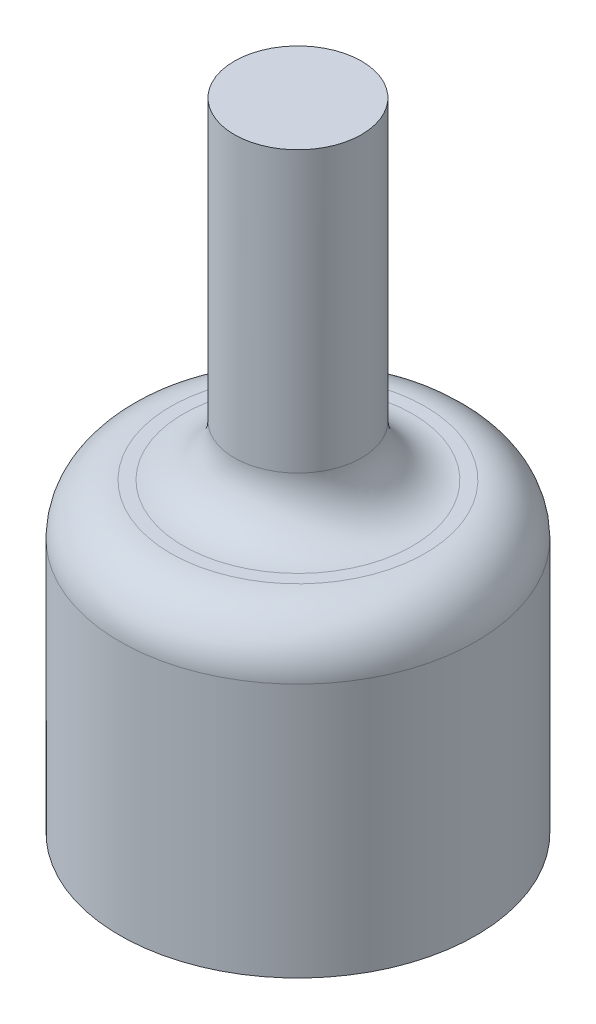
ISO-10303-21;
HEADER;
FILE_DESCRIPTION(('STEP AP214'),'2;1');
FILE_NAME('part.step','',(''),(''),'','','');
FILE_SCHEMA(('AUTOMOTIVE_DESIGN { 1 0 10303 214 1 1 1 1 }'));
ENDSEC;
DATA;
#1=APPLICATION_CONTEXT('core data for automotive mechanical design processes');
#2=APPLICATION_PROTOCOL_DEFINITION('international standard','automotive_design',2000,#1);
#3=PRODUCT_CONTEXT('',#1,'mechanical');
#4=PRODUCT('Part','Part','',(#3));
#5=PRODUCT_RELATED_PRODUCT_CATEGORY('part','',(#4));
#6=PRODUCT_DEFINITION_FORMATION('','',#4);
#7=PRODUCT_DEFINITION_CONTEXT('part definition',#1,'design');
#8=PRODUCT_DEFINITION('design','',#6,#7);
#9=PRODUCT_DEFINITION_SHAPE('','',#8);
#10=(LENGTH_UNIT() NAMED_UNIT(*) SI_UNIT(.MILLI.,.METRE.));
#11=(NAMED_UNIT(*) PLANE_ANGLE_UNIT() SI_UNIT($,.RADIAN.));
#12=(NAMED_UNIT(*) SI_UNIT($,.STERADIAN.) SOLID_ANGLE_UNIT());
#13=UNCERTAINTY_MEASURE_WITH_UNIT(LENGTH_MEASURE(1.E-05),#10,'distance_accuracy_value','');
#14=(GEOMETRIC_REPRESENTATION_CONTEXT(3) GLOBAL_UNCERTAINTY_ASSIGNED_CONTEXT((#13)) GLOBAL_UNIT_ASSIGNED_CONTEXT((#10,
#11,#12)) REPRESENTATION_CONTEXT('',''));
#15=CARTESIAN_POINT('',(0.,0.,0.));
#16=DIRECTION('',(0.,0.,1.));
#17=DIRECTION('',(1.,0.,0.));
#18=AXIS2_PLACEMENT_3D('',#15,#16,#17);
#19=CARTESIAN_POINT('',(0.,20.,0.));
#20=DIRECTION('',(0.,-1.,0.));
#21=DIRECTION('',(0.,0.,-1.));
#22=AXIS2_PLACEMENT_3D('',#19,#20,#21);
#23=CYLINDRICAL_SURFACE('',#22,2.5);
#24=CARTESIAN_POINT('',(0.,9.,0.));
#25=DIRECTION('',(0.,-1.,0.));
#26=DIRECTION('',(0.,0.,-1.));
#27=AXIS2_PLACEMENT_3D('',#24,#25,#26);
#28=CIRCLE('',#27,2.5);
#29=CARTESIAN_POINT('',(0.,9.,-2.5));
#30=VERTEX_POINT('',#29);
#31=EDGE_CURVE('E105',#30,#30,#28,.F.);
#32=ORIENTED_EDGE('',*,*,#31,.T.);
#33=EDGE_LOOP('',(#32));
#34=FACE_BOUND('',#33,.T.);
#35=CARTESIAN_POINT('',(0.,20.,0.));
#36=DIRECTION('',(0.,1.,0.));
#37=DIRECTION('',(0.,0.,1.));
#38=AXIS2_PLACEMENT_3D('',#35,#36,#37);
#39=CIRCLE('',#38,2.5);
#40=CARTESIAN_POINT('',(0.,20.,2.5));
#41=VERTEX_POINT('',#40);
#42=EDGE_CURVE('E81',#41,#41,#39,.T.);
#43=ORIENTED_EDGE('',*,*,#42,.F.);
#44=EDGE_LOOP('',(#43));
#45=FACE_BOUND('',#44,.T.);
#46=ADVANCED_FACE('F44',(#34,#45),#23,.T.);
#47=CARTESIAN_POINT('',(0.,20.,0.));
#48=DIRECTION('',(0.,1.,0.));
#49=DIRECTION('',(0.,0.,1.));
#50=AXIS2_PLACEMENT_3D('',#47,#48,#49);
#51=PLANE('',#50);
#52=ORIENTED_EDGE('',*,*,#42,.T.);
#53=EDGE_LOOP('',(#52));
#54=FACE_BOUND('',#53,.T.);
#55=ADVANCED_FACE('F124',(#54),#51,.T.);
#56=CARTESIAN_POINT('',(0.,7.,0.));
#57=DIRECTION('',(0.,-1.,0.));
#58=DIRECTION('',(0.,0.,-1.));
#59=AXIS2_PLACEMENT_3D('',#56,#57,#58);
#60=PLANE('',#59);
#61=CARTESIAN_POINT('',(0.,7.,0.));
#62=DIRECTION('',(0.,-1.,0.));
#63=DIRECTION('',(0.,0.,-1.));
#64=AXIS2_PLACEMENT_3D('',#61,#62,#63);
#65=CIRCLE('',#64,5.);
#66=CARTESIAN_POINT('',(0.,7.,-5.));
#67=VERTEX_POINT('',#66);
#68=EDGE_CURVE('E11',#67,#67,#65,.F.);
#69=ORIENTED_EDGE('',*,*,#68,.T.);
#70=EDGE_LOOP('',(#69));
#71=FACE_BOUND('',#70,.T.);
#72=CARTESIAN_POINT('',(0.,7.,0.));
#73=DIRECTION('',(0.,-1.,0.));
#74=DIRECTION('',(0.,0.,-1.));
#75=AXIS2_PLACEMENT_3D('',#72,#73,#74);
#76=CIRCLE('',#75,4.5);
#77=CARTESIAN_POINT('',(0.,7.,-4.5));
#78=VERTEX_POINT('',#77);
#79=EDGE_CURVE('E80',#78,#78,#76,.T.);
#80=ORIENTED_EDGE('',*,*,#79,.T.);
#81=EDGE_LOOP('',(#80));
#82=FACE_BOUND('',#81,.T.);
#83=ADVANCED_FACE('F130',(#71,#82),#60,.F.);
#84=CARTESIAN_POINT('',(0.,-5.,1.75));
#85=DIRECTION('',(0.,0.,1.));
#86=DIRECTION('',(1.,0.,0.));
#87=AXIS2_PLACEMENT_3D('',#84,#85,#86);
#88=PLANE('',#87);
#89=DIRECTION('',(0.,1.,0.));
#90=VECTOR('',#89,1.);
#91=CARTESIAN_POINT('',(-2.37486841740758,-5.,1.75));
#92=LINE('',#91,#90);
#93=CARTESIAN_POINT('',(-2.37486841740758,-5.,1.75));
#94=VERTEX_POINT('',#93);
#95=CARTESIAN_POINT('',(-2.37486841740758,5.,1.75));
#96=VERTEX_POINT('',#95);
#97=EDGE_CURVE('E77',#94,#96,#92,.T.);
#98=ORIENTED_EDGE('',*,*,#97,.T.);
#99=DIRECTION('',(1.,0.,0.));
#100=VECTOR('',#99,1.);
#101=CARTESIAN_POINT('',(0.,5.,1.75));
#102=LINE('',#101,#100);
#103=CARTESIAN_POINT('',(2.37486841740758,5.,1.75));
#104=VERTEX_POINT('',#103);
#105=EDGE_CURVE('E70',#96,#104,#102,.T.);
#106=ORIENTED_EDGE('',*,*,#105,.T.);
#107=DIRECTION('',(0.,1.,0.));
#108=VECTOR('',#107,1.);
#109=CARTESIAN_POINT('',(2.37486841740758,-5.,1.75));
#110=LINE('',#109,#108);
#111=CARTESIAN_POINT('',(2.37486841740758,-5.,1.75));
#112=VERTEX_POINT('',#111);
#113=EDGE_CURVE('E75',#112,#104,#110,.T.);
#114=ORIENTED_EDGE('',*,*,#113,.F.);
#115=DIRECTION('',(1.,0.,0.));
#116=VECTOR('',#115,1.);
#117=CARTESIAN_POINT('',(0.,-5.,1.75));
#118=LINE('',#117,#116);
#119=EDGE_CURVE('E60',#94,#112,#118,.T.);
#120=ORIENTED_EDGE('',*,*,#119,.F.);
#121=EDGE_LOOP('',(#98,#106,#114,#120));
#122=FACE_BOUND('',#121,.T.);
#123=ADVANCED_FACE('F73',(#122),#88,.F.);
#124=CARTESIAN_POINT('',(0.,-5.,0.));
#125=DIRECTION('',(0.,1.,0.));
#126=DIRECTION('',(0.,0.,1.));
#127=AXIS2_PLACEMENT_3D('',#124,#125,#126);
#128=CYLINDRICAL_SURFACE('',#127,2.95);
#129=CARTESIAN_POINT('',(0.,5.,0.));
#130=DIRECTION('',(0.,-1.,0.));
#131=DIRECTION('',(0.,0.,-1.));
#132=AXIS2_PLACEMENT_3D('',#129,#130,#131);
#133=CIRCLE('',#132,2.95);
#134=EDGE_CURVE('E83',#96,#104,#133,.T.);
#135=ORIENTED_EDGE('',*,*,#134,.F.);
#136=ORIENTED_EDGE('',*,*,#97,.F.);
#137=CARTESIAN_POINT('',(0.,-5.,0.));
#138=DIRECTION('',(0.,-1.,0.));
#139=DIRECTION('',(0.,0.,-1.));
#140=AXIS2_PLACEMENT_3D('',#137,#138,#139);
#141=CIRCLE('',#140,2.95);
#142=EDGE_CURVE('E87',#94,#112,#141,.T.);
#143=ORIENTED_EDGE('',*,*,#142,.T.);
#144=ORIENTED_EDGE('',*,*,#113,.T.);
#145=EDGE_LOOP('',(#135,#136,#143,#144));
#146=FACE_BOUND('',#145,.T.);
#147=ADVANCED_FACE('F89',(#146),#128,.F.);
#148=CARTESIAN_POINT('',(0.,5.,0.));
#149=DIRECTION('',(0.,1.,0.));
#150=DIRECTION('',(0.,0.,1.));
#151=AXIS2_PLACEMENT_3D('',#148,#149,#150);
#152=PLANE('',#151);
#153=ORIENTED_EDGE('',*,*,#105,.F.);
#154=ORIENTED_EDGE('',*,*,#134,.T.);
#155=EDGE_LOOP('',(#153,#154));
#156=FACE_BOUND('',#155,.T.);
#157=ADVANCED_FACE('F84',(#156),#152,.F.);
#158=CARTESIAN_POINT('',(0.,-5.,0.));
#159=DIRECTION('',(0.,-1.,0.));
#160=DIRECTION('',(0.,0.,-1.));
#161=AXIS2_PLACEMENT_3D('',#158,#159,#160);
#162=PLANE('',#161);
#163=ORIENTED_EDGE('',*,*,#142,.F.);
#164=ORIENTED_EDGE('',*,*,#119,.T.);
#165=EDGE_LOOP('',(#163,#164));
#166=FACE_BOUND('',#165,.T.);
#167=CARTESIAN_POINT('',(0.,-5.,0.));
#168=DIRECTION('',(0.,-1.,0.));
#169=DIRECTION('',(0.,0.,-1.));
#170=AXIS2_PLACEMENT_3D('',#167,#168,#169);
#171=CIRCLE('',#170,7.);
#172=CARTESIAN_POINT('',(0.,-5.,-7.));
#173=VERTEX_POINT('',#172);
#174=EDGE_CURVE('E91',#173,#173,#171,.T.);
#175=ORIENTED_EDGE('',*,*,#174,.T.);
#176=EDGE_LOOP('',(#175));
#177=FACE_BOUND('',#176,.T.);
#178=ADVANCED_FACE('F137',(#166,#177),#162,.T.);
#179=CARTESIAN_POINT('',(0.,-5.,0.));
#180=DIRECTION('',(0.,1.,0.));
#181=DIRECTION('',(0.,0.,1.));
#182=AXIS2_PLACEMENT_3D('',#179,#180,#181);
#183=CYLINDRICAL_SURFACE('',#182,7.);
#184=CARTESIAN_POINT('',(0.,5.,0.));
#185=DIRECTION('',(0.,-1.,0.));
#186=DIRECTION('',(0.,0.,-1.));
#187=AXIS2_PLACEMENT_3D('',#184,#185,#186);
#188=CIRCLE('',#187,7.);
#189=CARTESIAN_POINT('',(0.,5.,-7.));
#190=VERTEX_POINT('',#189);
#191=EDGE_CURVE('E54',#190,#190,#188,.T.);
#192=ORIENTED_EDGE('',*,*,#191,.T.);
#193=EDGE_LOOP('',(#192));
#194=FACE_BOUND('',#193,.T.);
#195=ORIENTED_EDGE('',*,*,#174,.F.);
#196=EDGE_LOOP('',(#195));
#197=FACE_BOUND('',#196,.T.);
#198=ADVANCED_FACE('F112',(#194,#197),#183,.T.);
#199=CARTESIAN_POINT('',(0.,9.,0.));
#200=DIRECTION('',(0.,-1.,0.));
#201=DIRECTION('',(0.,0.,-1.));
#202=AXIS2_PLACEMENT_3D('',#199,#200,#201);
#203=TOROIDAL_SURFACE('',#202,4.5,2.);
#204=ORIENTED_EDGE('',*,*,#31,.F.);
#205=EDGE_LOOP('',(#204));
#206=FACE_BOUND('',#205,.T.);
#207=ORIENTED_EDGE('',*,*,#79,.F.);
#208=EDGE_LOOP('',(#207));
#209=FACE_BOUND('',#208,.T.);
#210=ADVANCED_FACE('F116',(#206,#209),#203,.F.);
#211=CARTESIAN_POINT('',(0.,5.,0.));
#212=DIRECTION('',(0.,-1.,0.));
#213=DIRECTION('',(0.,0.,-1.));
#214=AXIS2_PLACEMENT_3D('',#211,#212,#213);
#215=TOROIDAL_SURFACE('',#214,5.,2.);
#216=ORIENTED_EDGE('',*,*,#68,.F.);
#217=EDGE_LOOP('',(#216));
#218=FACE_BOUND('',#217,.T.);
#219=ORIENTED_EDGE('',*,*,#191,.F.);
#220=EDGE_LOOP('',(#219));
#221=FACE_BOUND('',#220,.T.);
#222=ADVANCED_FACE('F46',(#218,#221),#215,.T.);
#223=CLOSED_SHELL('',(#46,#55,#83,#123,#147,#157,#178,#198,#210,#222));
#224=MANIFOLD_SOLID_BREP('B2',#223);
#225=ADVANCED_BREP_SHAPE_REPRESENTATION('',(#18,#224),#14);
#226=SHAPE_DEFINITION_REPRESENTATION(#9,#225);
ENDSEC;
END-ISO-10303-21;
